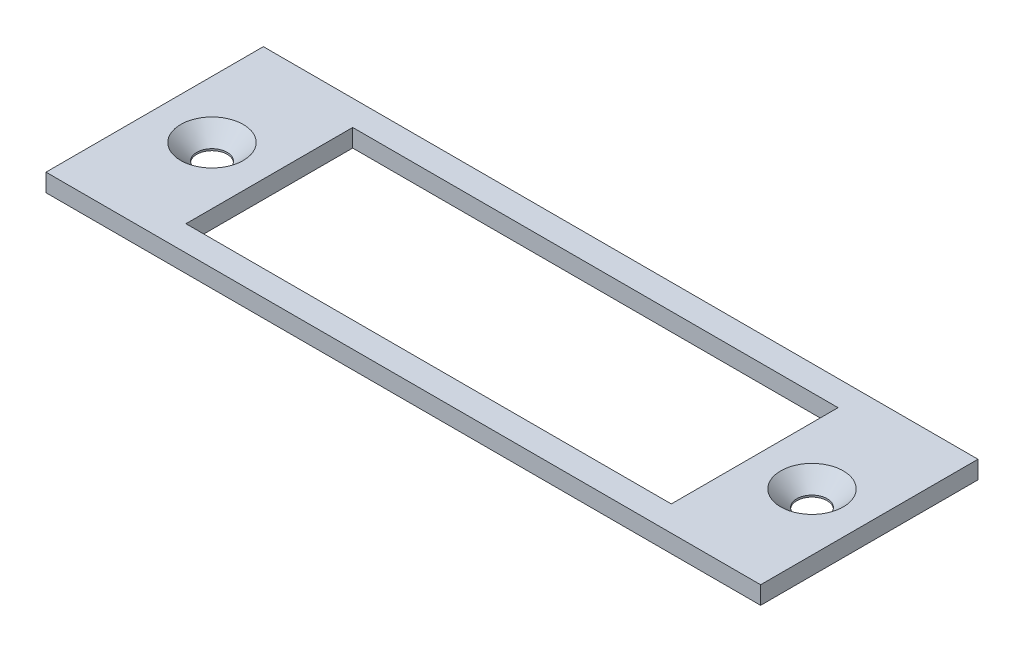
ISO-10303-21;
HEADER;
FILE_DESCRIPTION(('STEP AP214'),'2;1');
FILE_NAME('part.step','',(''),(''),'','','');
FILE_SCHEMA(('AUTOMOTIVE_DESIGN { 1 0 10303 214 1 1 1 1 }'));
ENDSEC;
DATA;
#1=APPLICATION_CONTEXT('core data for automotive mechanical design processes');
#2=APPLICATION_PROTOCOL_DEFINITION('international standard','automotive_design',2000,#1);
#3=PRODUCT_CONTEXT('',#1,'mechanical');
#4=PRODUCT('Part','Part','',(#3));
#5=PRODUCT_RELATED_PRODUCT_CATEGORY('part','',(#4));
#6=PRODUCT_DEFINITION_FORMATION('','',#4);
#7=PRODUCT_DEFINITION_CONTEXT('part definition',#1,'design');
#8=PRODUCT_DEFINITION('design','',#6,#7);
#9=PRODUCT_DEFINITION_SHAPE('','',#8);
#10=(LENGTH_UNIT() NAMED_UNIT(*) SI_UNIT(.MILLI.,.METRE.));
#11=(NAMED_UNIT(*) PLANE_ANGLE_UNIT() SI_UNIT($,.RADIAN.));
#12=(NAMED_UNIT(*) SI_UNIT($,.STERADIAN.) SOLID_ANGLE_UNIT());
#13=UNCERTAINTY_MEASURE_WITH_UNIT(LENGTH_MEASURE(1.E-05),#10,'distance_accuracy_value','');
#14=(GEOMETRIC_REPRESENTATION_CONTEXT(3) GLOBAL_UNCERTAINTY_ASSIGNED_CONTEXT((#13)) GLOBAL_UNIT_ASSIGNED_CONTEXT((#10,
#11,#12)) REPRESENTATION_CONTEXT('',''));
#15=CARTESIAN_POINT('',(0.,0.,0.));
#16=DIRECTION('',(0.,0.,1.));
#17=DIRECTION('',(1.,0.,0.));
#18=AXIS2_PLACEMENT_3D('',#15,#16,#17);
#19=CARTESIAN_POINT('',(0.,3.,0.));
#20=DIRECTION('',(1.,0.,0.));
#21=DIRECTION('',(0.,0.,-1.));
#22=AXIS2_PLACEMENT_3D('',#19,#20,#21);
#23=PLANE('',#22);
#24=DIRECTION('',(0.,0.,1.));
#25=VECTOR('',#24,1.);
#26=CARTESIAN_POINT('',(0.,0.,0.));
#27=LINE('',#26,#25);
#28=CARTESIAN_POINT('',(0.,0.,0.));
#29=VERTEX_POINT('',#28);
#30=CARTESIAN_POINT('',(0.,0.,36.5));
#31=VERTEX_POINT('',#30);
#32=EDGE_CURVE('E136',#29,#31,#27,.T.);
#33=ORIENTED_EDGE('',*,*,#32,.T.);
#34=DIRECTION('',(0.,-1.,0.));
#35=VECTOR('',#34,1.);
#36=CARTESIAN_POINT('',(0.,3.,36.5));
#37=LINE('',#36,#35);
#38=CARTESIAN_POINT('',(0.,3.,36.5));
#39=VERTEX_POINT('',#38);
#40=EDGE_CURVE('E11',#39,#31,#37,.T.);
#41=ORIENTED_EDGE('',*,*,#40,.F.);
#42=DIRECTION('',(0.,0.,1.));
#43=VECTOR('',#42,1.);
#44=CARTESIAN_POINT('',(0.,3.,0.));
#45=LINE('',#44,#43);
#46=CARTESIAN_POINT('',(0.,3.,0.));
#47=VERTEX_POINT('',#46);
#48=EDGE_CURVE('E140',#47,#39,#45,.T.);
#49=ORIENTED_EDGE('',*,*,#48,.F.);
#50=DIRECTION('',(0.,-1.,0.));
#51=VECTOR('',#50,1.);
#52=CARTESIAN_POINT('',(0.,3.,0.));
#53=LINE('',#52,#51);
#54=EDGE_CURVE('E150',#47,#29,#53,.T.);
#55=ORIENTED_EDGE('',*,*,#54,.T.);
#56=EDGE_LOOP('',(#33,#41,#49,#55));
#57=FACE_BOUND('',#56,.T.);
#58=ADVANCED_FACE('F36',(#57),#23,.F.);
#59=CARTESIAN_POINT('',(0.,3.,36.5));
#60=DIRECTION('',(0.,0.,-1.));
#61=DIRECTION('',(-1.,0.,0.));
#62=AXIS2_PLACEMENT_3D('',#59,#60,#61);
#63=PLANE('',#62);
#64=DIRECTION('',(1.,0.,0.));
#65=VECTOR('',#64,1.);
#66=CARTESIAN_POINT('',(0.,0.,36.5));
#67=LINE('',#66,#65);
#68=CARTESIAN_POINT('',(120.,0.,36.5));
#69=VERTEX_POINT('',#68);
#70=EDGE_CURVE('E153',#31,#69,#67,.T.);
#71=ORIENTED_EDGE('',*,*,#70,.T.);
#72=DIRECTION('',(0.,-1.,0.));
#73=VECTOR('',#72,1.);
#74=CARTESIAN_POINT('',(120.,3.,36.5));
#75=LINE('',#74,#73);
#76=CARTESIAN_POINT('',(120.,3.,36.5));
#77=VERTEX_POINT('',#76);
#78=EDGE_CURVE('E43',#77,#69,#75,.T.);
#79=ORIENTED_EDGE('',*,*,#78,.F.);
#80=DIRECTION('',(1.,0.,0.));
#81=VECTOR('',#80,1.);
#82=CARTESIAN_POINT('',(0.,3.,36.5));
#83=LINE('',#82,#81);
#84=EDGE_CURVE('E143',#39,#77,#83,.T.);
#85=ORIENTED_EDGE('',*,*,#84,.F.);
#86=ORIENTED_EDGE('',*,*,#40,.T.);
#87=EDGE_LOOP('',(#71,#79,#85,#86));
#88=FACE_BOUND('',#87,.T.);
#89=ADVANCED_FACE('F181',(#88),#63,.F.);
#90=CARTESIAN_POINT('',(120.,3.,0.));
#91=DIRECTION('',(-1.,0.,0.));
#92=DIRECTION('',(0.,0.,1.));
#93=AXIS2_PLACEMENT_3D('',#90,#91,#92);
#94=PLANE('',#93);
#95=DIRECTION('',(0.,0.,-1.));
#96=VECTOR('',#95,1.);
#97=CARTESIAN_POINT('',(120.,0.,0.));
#98=LINE('',#97,#96);
#99=CARTESIAN_POINT('',(120.,0.,0.));
#100=VERTEX_POINT('',#99);
#101=EDGE_CURVE('E155',#69,#100,#98,.T.);
#102=ORIENTED_EDGE('',*,*,#101,.T.);
#103=DIRECTION('',(0.,-1.,0.));
#104=VECTOR('',#103,1.);
#105=CARTESIAN_POINT('',(120.,3.,0.));
#106=LINE('',#105,#104);
#107=CARTESIAN_POINT('',(120.,3.,0.));
#108=VERTEX_POINT('',#107);
#109=EDGE_CURVE('E160',#108,#100,#106,.T.);
#110=ORIENTED_EDGE('',*,*,#109,.F.);
#111=DIRECTION('',(0.,0.,-1.));
#112=VECTOR('',#111,1.);
#113=CARTESIAN_POINT('',(120.,3.,0.));
#114=LINE('',#113,#112);
#115=EDGE_CURVE('E146',#77,#108,#114,.T.);
#116=ORIENTED_EDGE('',*,*,#115,.F.);
#117=ORIENTED_EDGE('',*,*,#78,.T.);
#118=EDGE_LOOP('',(#102,#110,#116,#117));
#119=FACE_BOUND('',#118,.T.);
#120=ADVANCED_FACE('F167',(#119),#94,.F.);
#121=CARTESIAN_POINT('',(0.,3.,0.));
#122=DIRECTION('',(0.,0.,1.));
#123=DIRECTION('',(1.,0.,0.));
#124=AXIS2_PLACEMENT_3D('',#121,#122,#123);
#125=PLANE('',#124);
#126=DIRECTION('',(-1.,0.,0.));
#127=VECTOR('',#126,1.);
#128=CARTESIAN_POINT('',(0.,0.,0.));
#129=LINE('',#128,#127);
#130=EDGE_CURVE('E144',#100,#29,#129,.T.);
#131=ORIENTED_EDGE('',*,*,#130,.T.);
#132=ORIENTED_EDGE('',*,*,#54,.F.);
#133=DIRECTION('',(-1.,0.,0.));
#134=VECTOR('',#133,1.);
#135=CARTESIAN_POINT('',(0.,3.,0.));
#136=LINE('',#135,#134);
#137=EDGE_CURVE('E148',#108,#47,#136,.T.);
#138=ORIENTED_EDGE('',*,*,#137,.F.);
#139=ORIENTED_EDGE('',*,*,#109,.T.);
#140=EDGE_LOOP('',(#131,#132,#138,#139));
#141=FACE_BOUND('',#140,.T.);
#142=ADVANCED_FACE('F174',(#141),#125,.F.);
#143=CARTESIAN_POINT('',(0.,3.,0.));
#144=DIRECTION('',(0.,1.,0.));
#145=DIRECTION('',(0.,0.,1.));
#146=AXIS2_PLACEMENT_3D('',#143,#144,#145);
#147=PLANE('',#146);
#148=CARTESIAN_POINT('',(9.625,3.,18.25));
#149=DIRECTION('',(0.,1.,0.));
#150=DIRECTION('',(0.,0.,1.));
#151=AXIS2_PLACEMENT_3D('',#148,#149,#150);
#152=CIRCLE('',#151,5.2500022);
#153=CARTESIAN_POINT('',(9.625,3.,23.5000022));
#154=VERTEX_POINT('',#153);
#155=EDGE_CURVE('E231',#154,#154,#152,.T.);
#156=ORIENTED_EDGE('',*,*,#155,.F.);
#157=EDGE_LOOP('',(#156));
#158=FACE_BOUND('',#157,.T.);
#159=CARTESIAN_POINT('',(110.375,3.,18.25));
#160=DIRECTION('',(0.,1.,0.));
#161=DIRECTION('',(0.,0.,1.));
#162=AXIS2_PLACEMENT_3D('',#159,#160,#161);
#163=CIRCLE('',#162,5.25000219999999);
#164=CARTESIAN_POINT('',(110.375,3.,23.5000022));
#165=VERTEX_POINT('',#164);
#166=EDGE_CURVE('E238',#165,#165,#163,.T.);
#167=ORIENTED_EDGE('',*,*,#166,.F.);
#168=EDGE_LOOP('',(#167));
#169=FACE_BOUND('',#168,.T.);
#170=DIRECTION('',(-1.,0.,0.));
#171=VECTOR('',#170,1.);
#172=CARTESIAN_POINT('',(60.,3.,4.25));
#173=LINE('',#172,#171);
#174=CARTESIAN_POINT('',(100.75,3.,4.25));
#175=VERTEX_POINT('',#174);
#176=CARTESIAN_POINT('',(19.25,3.,4.25));
#177=VERTEX_POINT('',#176);
#178=EDGE_CURVE('E104',#175,#177,#173,.T.);
#179=ORIENTED_EDGE('',*,*,#178,.F.);
#180=DIRECTION('',(0.,0.,-1.));
#181=VECTOR('',#180,1.);
#182=CARTESIAN_POINT('',(100.75,3.,32.25));
#183=LINE('',#182,#181);
#184=CARTESIAN_POINT('',(100.75,3.,32.25));
#185=VERTEX_POINT('',#184);
#186=EDGE_CURVE('E119',#185,#175,#183,.T.);
#187=ORIENTED_EDGE('',*,*,#186,.F.);
#188=DIRECTION('',(1.,0.,0.));
#189=VECTOR('',#188,1.);
#190=CARTESIAN_POINT('',(19.25,3.,32.25));
#191=LINE('',#190,#189);
#192=CARTESIAN_POINT('',(19.25,3.,32.25));
#193=VERTEX_POINT('',#192);
#194=EDGE_CURVE('E129',#193,#185,#191,.T.);
#195=ORIENTED_EDGE('',*,*,#194,.F.);
#196=DIRECTION('',(0.,0.,1.));
#197=VECTOR('',#196,1.);
#198=CARTESIAN_POINT('',(19.25,3.,4.25));
#199=LINE('',#198,#197);
#200=EDGE_CURVE('E127',#177,#193,#199,.T.);
#201=ORIENTED_EDGE('',*,*,#200,.F.);
#202=EDGE_LOOP('',(#179,#187,#195,#201));
#203=FACE_BOUND('',#202,.T.);
#204=ORIENTED_EDGE('',*,*,#48,.T.);
#205=ORIENTED_EDGE('',*,*,#84,.T.);
#206=ORIENTED_EDGE('',*,*,#115,.T.);
#207=ORIENTED_EDGE('',*,*,#137,.T.);
#208=EDGE_LOOP('',(#204,#205,#206,#207));
#209=FACE_BOUND('',#208,.T.);
#210=ADVANCED_FACE('F180',(#158,#169,#203,#209),#147,.T.);
#211=CARTESIAN_POINT('',(0.,0.,0.));
#212=DIRECTION('',(0.,1.,0.));
#213=DIRECTION('',(0.,0.,1.));
#214=AXIS2_PLACEMENT_3D('',#211,#212,#213);
#215=PLANE('',#214);
#216=CARTESIAN_POINT('',(9.625,0.,18.25));
#217=DIRECTION('',(0.,1.,0.));
#218=DIRECTION('',(0.,0.,1.));
#219=AXIS2_PLACEMENT_3D('',#216,#217,#218);
#220=CIRCLE('',#219,2.5499949);
#221=CARTESIAN_POINT('',(9.625,0.,20.7999949));
#222=VERTEX_POINT('',#221);
#223=EDGE_CURVE('E233',#222,#222,#220,.T.);
#224=ORIENTED_EDGE('',*,*,#223,.T.);
#225=EDGE_LOOP('',(#224));
#226=FACE_BOUND('',#225,.T.);
#227=CARTESIAN_POINT('',(110.375,0.,18.25));
#228=DIRECTION('',(0.,1.,0.));
#229=DIRECTION('',(0.,0.,1.));
#230=AXIS2_PLACEMENT_3D('',#227,#228,#229);
#231=CIRCLE('',#230,2.54999490000001);
#232=CARTESIAN_POINT('',(110.375,0.,20.7999949));
#233=VERTEX_POINT('',#232);
#234=EDGE_CURVE('E122',#233,#233,#231,.T.);
#235=ORIENTED_EDGE('',*,*,#234,.T.);
#236=EDGE_LOOP('',(#235));
#237=FACE_BOUND('',#236,.T.);
#238=DIRECTION('',(0.,0.,-1.));
#239=VECTOR('',#238,1.);
#240=CARTESIAN_POINT('',(100.75,0.,32.25));
#241=LINE('',#240,#239);
#242=CARTESIAN_POINT('',(100.75,0.,32.25));
#243=VERTEX_POINT('',#242);
#244=CARTESIAN_POINT('',(100.75,0.,4.25));
#245=VERTEX_POINT('',#244);
#246=EDGE_CURVE('E107',#243,#245,#241,.T.);
#247=ORIENTED_EDGE('',*,*,#246,.T.);
#248=DIRECTION('',(-1.,0.,0.));
#249=VECTOR('',#248,1.);
#250=CARTESIAN_POINT('',(60.,0.,4.25));
#251=LINE('',#250,#249);
#252=CARTESIAN_POINT('',(19.25,0.,4.25));
#253=VERTEX_POINT('',#252);
#254=EDGE_CURVE('E101',#245,#253,#251,.T.);
#255=ORIENTED_EDGE('',*,*,#254,.T.);
#256=DIRECTION('',(0.,0.,1.));
#257=VECTOR('',#256,1.);
#258=CARTESIAN_POINT('',(19.25,0.,4.25));
#259=LINE('',#258,#257);
#260=CARTESIAN_POINT('',(19.25,0.,32.25));
#261=VERTEX_POINT('',#260);
#262=EDGE_CURVE('E110',#253,#261,#259,.T.);
#263=ORIENTED_EDGE('',*,*,#262,.T.);
#264=DIRECTION('',(1.,0.,0.));
#265=VECTOR('',#264,1.);
#266=CARTESIAN_POINT('',(19.25,0.,32.25));
#267=LINE('',#266,#265);
#268=EDGE_CURVE('E58',#261,#243,#267,.T.);
#269=ORIENTED_EDGE('',*,*,#268,.T.);
#270=EDGE_LOOP('',(#247,#255,#263,#269));
#271=FACE_BOUND('',#270,.T.);
#272=ORIENTED_EDGE('',*,*,#32,.F.);
#273=ORIENTED_EDGE('',*,*,#130,.F.);
#274=ORIENTED_EDGE('',*,*,#101,.F.);
#275=ORIENTED_EDGE('',*,*,#70,.F.);
#276=EDGE_LOOP('',(#272,#273,#274,#275));
#277=FACE_BOUND('',#276,.T.);
#278=ADVANCED_FACE('F115',(#226,#237,#271,#277),#215,.F.);
#279=CARTESIAN_POINT('',(60.,0.,4.25));
#280=DIRECTION('',(0.,0.,-1.));
#281=DIRECTION('',(-1.,0.,0.));
#282=AXIS2_PLACEMENT_3D('',#279,#280,#281);
#283=PLANE('',#282);
#284=ORIENTED_EDGE('',*,*,#178,.T.);
#285=DIRECTION('',(0.,1.,0.));
#286=VECTOR('',#285,1.);
#287=CARTESIAN_POINT('',(19.25,0.,4.25));
#288=LINE('',#287,#286);
#289=EDGE_CURVE('E50',#253,#177,#288,.T.);
#290=ORIENTED_EDGE('',*,*,#289,.F.);
#291=ORIENTED_EDGE('',*,*,#254,.F.);
#292=DIRECTION('',(0.,1.,0.));
#293=VECTOR('',#292,1.);
#294=CARTESIAN_POINT('',(100.75,0.,4.25));
#295=LINE('',#294,#293);
#296=EDGE_CURVE('E134',#245,#175,#295,.T.);
#297=ORIENTED_EDGE('',*,*,#296,.T.);
#298=EDGE_LOOP('',(#284,#290,#291,#297));
#299=FACE_BOUND('',#298,.T.);
#300=ADVANCED_FACE('F99',(#299),#283,.F.);
#301=CARTESIAN_POINT('',(100.75,0.,32.25));
#302=DIRECTION('',(1.,0.,0.));
#303=DIRECTION('',(0.,0.,-1.));
#304=AXIS2_PLACEMENT_3D('',#301,#302,#303);
#305=PLANE('',#304);
#306=ORIENTED_EDGE('',*,*,#186,.T.);
#307=ORIENTED_EDGE('',*,*,#296,.F.);
#308=ORIENTED_EDGE('',*,*,#246,.F.);
#309=DIRECTION('',(0.,1.,0.));
#310=VECTOR('',#309,1.);
#311=CARTESIAN_POINT('',(100.75,0.,32.25));
#312=LINE('',#311,#310);
#313=EDGE_CURVE('E137',#243,#185,#312,.T.);
#314=ORIENTED_EDGE('',*,*,#313,.T.);
#315=EDGE_LOOP('',(#306,#307,#308,#314));
#316=FACE_BOUND('',#315,.T.);
#317=ADVANCED_FACE('F203',(#316),#305,.F.);
#318=CARTESIAN_POINT('',(19.25,0.,32.25));
#319=DIRECTION('',(0.,0.,1.));
#320=DIRECTION('',(1.,0.,0.));
#321=AXIS2_PLACEMENT_3D('',#318,#319,#320);
#322=PLANE('',#321);
#323=ORIENTED_EDGE('',*,*,#194,.T.);
#324=ORIENTED_EDGE('',*,*,#313,.F.);
#325=ORIENTED_EDGE('',*,*,#268,.F.);
#326=DIRECTION('',(0.,1.,0.));
#327=VECTOR('',#326,1.);
#328=CARTESIAN_POINT('',(19.25,0.,32.25));
#329=LINE('',#328,#327);
#330=EDGE_CURVE('E106',#261,#193,#329,.T.);
#331=ORIENTED_EDGE('',*,*,#330,.T.);
#332=EDGE_LOOP('',(#323,#324,#325,#331));
#333=FACE_BOUND('',#332,.T.);
#334=ADVANCED_FACE('F200',(#333),#322,.F.);
#335=CARTESIAN_POINT('',(19.25,0.,4.25));
#336=DIRECTION('',(-1.,0.,0.));
#337=DIRECTION('',(0.,0.,1.));
#338=AXIS2_PLACEMENT_3D('',#335,#336,#337);
#339=PLANE('',#338);
#340=ORIENTED_EDGE('',*,*,#200,.T.);
#341=ORIENTED_EDGE('',*,*,#330,.F.);
#342=ORIENTED_EDGE('',*,*,#262,.F.);
#343=ORIENTED_EDGE('',*,*,#289,.T.);
#344=EDGE_LOOP('',(#340,#341,#342,#343));
#345=FACE_BOUND('',#344,.T.);
#346=ADVANCED_FACE('F111',(#345),#339,.F.);
#347=CARTESIAN_POINT('',(110.375,3.,18.25));
#348=DIRECTION('',(0.,1.,0.));
#349=DIRECTION('',(0.,0.,1.));
#350=AXIS2_PLACEMENT_3D('',#347,#348,#349);
#351=CYLINDRICAL_SURFACE('',#350,2.54999490000001);
#352=ORIENTED_EDGE('',*,*,#234,.F.);
#353=EDGE_LOOP('',(#352));
#354=FACE_BOUND('',#353,.T.);
#355=CARTESIAN_POINT('',(110.375,0.299992699999999,18.25));
#356=DIRECTION('',(0.,1.,0.));
#357=DIRECTION('',(0.,0.,1.));
#358=AXIS2_PLACEMENT_3D('',#355,#356,#357);
#359=CIRCLE('',#358,2.54999490000001);
#360=CARTESIAN_POINT('',(110.375,0.299992699999999,20.7999949));
#361=VERTEX_POINT('',#360);
#362=EDGE_CURVE('E240',#361,#361,#359,.T.);
#363=ORIENTED_EDGE('',*,*,#362,.T.);
#364=EDGE_LOOP('',(#363));
#365=FACE_BOUND('',#364,.T.);
#366=ADVANCED_FACE('F199',(#354,#365),#351,.F.);
#367=CARTESIAN_POINT('',(110.375,3.,18.25));
#368=DIRECTION('',(0.,1.,0.));
#369=DIRECTION('',(0.,0.,1.));
#370=AXIS2_PLACEMENT_3D('',#367,#368,#369);
#371=CONICAL_SURFACE('',#370,5.25000219999999,0.785398163397445);
#372=ORIENTED_EDGE('',*,*,#362,.F.);
#373=EDGE_LOOP('',(#372));
#374=FACE_BOUND('',#373,.T.);
#375=ORIENTED_EDGE('',*,*,#166,.T.);
#376=EDGE_LOOP('',(#375));
#377=FACE_BOUND('',#376,.T.);
#378=ADVANCED_FACE('F211',(#374,#377),#371,.F.);
#379=CARTESIAN_POINT('',(9.625,3.,18.25));
#380=DIRECTION('',(0.,1.,0.));
#381=DIRECTION('',(0.,0.,1.));
#382=AXIS2_PLACEMENT_3D('',#379,#380,#381);
#383=CYLINDRICAL_SURFACE('',#382,2.5499949);
#384=ORIENTED_EDGE('',*,*,#223,.F.);
#385=EDGE_LOOP('',(#384));
#386=FACE_BOUND('',#385,.T.);
#387=CARTESIAN_POINT('',(9.625,0.299992699999999,18.25));
#388=DIRECTION('',(0.,1.,0.));
#389=DIRECTION('',(0.,0.,1.));
#390=AXIS2_PLACEMENT_3D('',#387,#388,#389);
#391=CIRCLE('',#390,2.5499949);
#392=CARTESIAN_POINT('',(9.625,0.299992699999999,20.7999949));
#393=VERTEX_POINT('',#392);
#394=EDGE_CURVE('E228',#393,#393,#391,.T.);
#395=ORIENTED_EDGE('',*,*,#394,.T.);
#396=EDGE_LOOP('',(#395));
#397=FACE_BOUND('',#396,.T.);
#398=ADVANCED_FACE('F215',(#386,#397),#383,.F.);
#399=CARTESIAN_POINT('',(9.625,3.,18.25));
#400=DIRECTION('',(0.,1.,0.));
#401=DIRECTION('',(0.,0.,1.));
#402=AXIS2_PLACEMENT_3D('',#399,#400,#401);
#403=CONICAL_SURFACE('',#402,5.2500022,0.785398163397448);
#404=ORIENTED_EDGE('',*,*,#394,.F.);
#405=EDGE_LOOP('',(#404));
#406=FACE_BOUND('',#405,.T.);
#407=ORIENTED_EDGE('',*,*,#155,.T.);
#408=EDGE_LOOP('',(#407));
#409=FACE_BOUND('',#408,.T.);
#410=ADVANCED_FACE('F219',(#406,#409),#403,.F.);
#411=CLOSED_SHELL('',(#58,#89,#120,#142,#210,#278,#300,#317,#334,#346,#366,#378,#398,#410));
#412=MANIFOLD_SOLID_BREP('B2',#411);
#413=ADVANCED_BREP_SHAPE_REPRESENTATION('',(#18,#412),#14);
#414=SHAPE_DEFINITION_REPRESENTATION(#9,#413);
ENDSEC;
END-ISO-10303-21;
